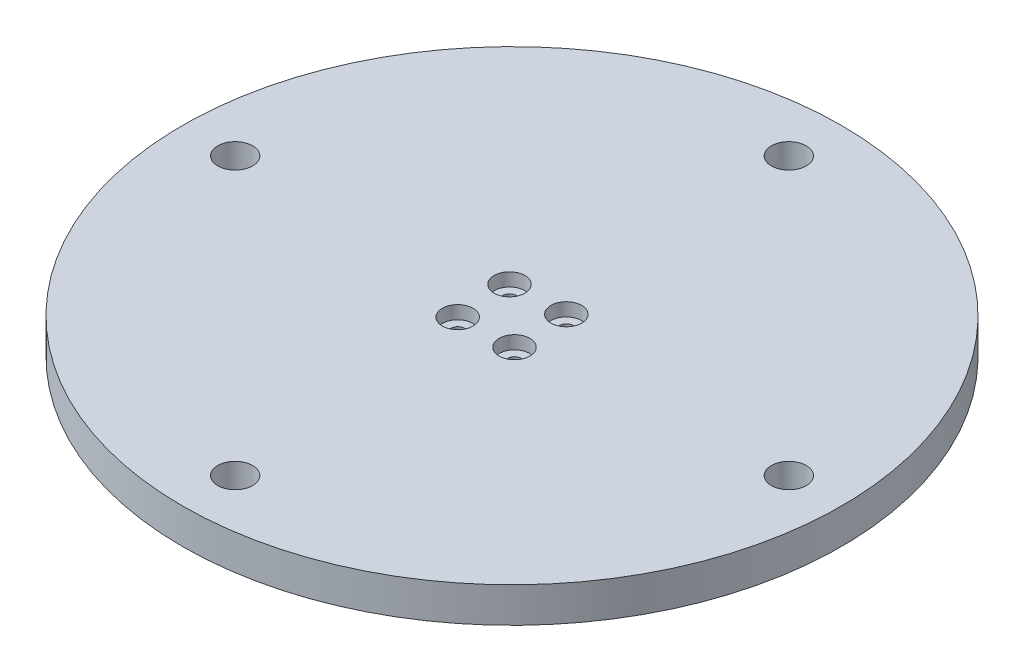
ISO-10303-21;
HEADER;
FILE_DESCRIPTION(('STEP AP214'),'2;1');
FILE_NAME('part.step','',(''),(''),'','','');
FILE_SCHEMA(('AUTOMOTIVE_DESIGN { 1 0 10303 214 1 1 1 1 }'));
ENDSEC;
DATA;
#1=APPLICATION_CONTEXT('core data for automotive mechanical design processes');
#2=APPLICATION_PROTOCOL_DEFINITION('international standard','automotive_design',2000,#1);
#3=PRODUCT_CONTEXT('',#1,'mechanical');
#4=PRODUCT('Part','Part','',(#3));
#5=PRODUCT_RELATED_PRODUCT_CATEGORY('part','',(#4));
#6=PRODUCT_DEFINITION_FORMATION('','',#4);
#7=PRODUCT_DEFINITION_CONTEXT('part definition',#1,'design');
#8=PRODUCT_DEFINITION('design','',#6,#7);
#9=PRODUCT_DEFINITION_SHAPE('','',#8);
#10=(LENGTH_UNIT() NAMED_UNIT(*) SI_UNIT(.MILLI.,.METRE.));
#11=(NAMED_UNIT(*) PLANE_ANGLE_UNIT() SI_UNIT($,.RADIAN.));
#12=(NAMED_UNIT(*) SI_UNIT($,.STERADIAN.) SOLID_ANGLE_UNIT());
#13=UNCERTAINTY_MEASURE_WITH_UNIT(LENGTH_MEASURE(1.E-05),#10,'distance_accuracy_value','');
#14=(GEOMETRIC_REPRESENTATION_CONTEXT(3) GLOBAL_UNCERTAINTY_ASSIGNED_CONTEXT((#13)) GLOBAL_UNIT_ASSIGNED_CONTEXT((#10,
#11,#12)) REPRESENTATION_CONTEXT('',''));
#15=CARTESIAN_POINT('',(0.,0.,0.));
#16=DIRECTION('',(0.,0.,1.));
#17=DIRECTION('',(1.,0.,0.));
#18=AXIS2_PLACEMENT_3D('',#15,#16,#17);
#19=CARTESIAN_POINT('',(5.89694767315849,16.,-6.46440315420037));
#20=DIRECTION('',(0.,1.,0.));
#21=DIRECTION('',(0.,0.,1.));
#22=AXIS2_PLACEMENT_3D('',#19,#20,#21);
#23=CYLINDRICAL_SURFACE('',#22,1.59);
#24=CARTESIAN_POINT('',(5.89694767315849,18.,-6.46440315420037));
#25=DIRECTION('',(0.,1.,0.));
#26=DIRECTION('',(0.,0.,1.));
#27=AXIS2_PLACEMENT_3D('',#24,#25,#26);
#28=CIRCLE('',#27,1.59);
#29=CARTESIAN_POINT('',(5.89694767315849,18.,-4.87440315420036));
#30=VERTEX_POINT('',#29);
#31=EDGE_CURVE('E102',#30,#30,#28,.T.);
#32=ORIENTED_EDGE('',*,*,#31,.F.);
#33=EDGE_LOOP('',(#32));
#34=FACE_BOUND('',#33,.T.);
#35=CARTESIAN_POINT('',(5.89694767315849,23.,-6.46440315420037));
#36=DIRECTION('',(0.,1.,0.));
#37=DIRECTION('',(0.,0.,1.));
#38=AXIS2_PLACEMENT_3D('',#35,#36,#37);
#39=CIRCLE('',#38,1.59);
#40=CARTESIAN_POINT('',(5.89694767315849,23.,-4.87440315420036));
#41=VERTEX_POINT('',#40);
#42=EDGE_CURVE('E51',#41,#41,#39,.F.);
#43=ORIENTED_EDGE('',*,*,#42,.F.);
#44=EDGE_LOOP('',(#43));
#45=FACE_BOUND('',#44,.T.);
#46=ADVANCED_FACE('F47',(#34,#45),#23,.F.);
#47=CARTESIAN_POINT('',(-5.89694767315863,16.,6.46440315419948));
#48=DIRECTION('',(0.,1.,0.));
#49=DIRECTION('',(0.,0.,1.));
#50=AXIS2_PLACEMENT_3D('',#47,#48,#49);
#51=CYLINDRICAL_SURFACE('',#50,1.59);
#52=CARTESIAN_POINT('',(-5.89694767315863,18.,6.46440315419948));
#53=DIRECTION('',(0.,1.,0.));
#54=DIRECTION('',(0.,0.,1.));
#55=AXIS2_PLACEMENT_3D('',#52,#53,#54);
#56=CIRCLE('',#55,1.59);
#57=CARTESIAN_POINT('',(-5.89694767315863,18.,8.05440315419948));
#58=VERTEX_POINT('',#57);
#59=EDGE_CURVE('E105',#58,#58,#56,.T.);
#60=ORIENTED_EDGE('',*,*,#59,.F.);
#61=EDGE_LOOP('',(#60));
#62=FACE_BOUND('',#61,.T.);
#63=CARTESIAN_POINT('',(-5.89694767315863,23.,6.46440315419948));
#64=DIRECTION('',(0.,1.,0.));
#65=DIRECTION('',(0.,0.,1.));
#66=AXIS2_PLACEMENT_3D('',#63,#64,#65);
#67=CIRCLE('',#66,1.59);
#68=CARTESIAN_POINT('',(-5.89694767315863,23.,8.05440315419948));
#69=VERTEX_POINT('',#68);
#70=EDGE_CURVE('E71',#69,#69,#67,.F.);
#71=ORIENTED_EDGE('',*,*,#70,.F.);
#72=EDGE_LOOP('',(#71));
#73=FACE_BOUND('',#72,.T.);
#74=ADVANCED_FACE('F144',(#62,#73),#51,.F.);
#75=CARTESIAN_POINT('',(6.49205336615537,16.,5.92217070599874));
#76=DIRECTION('',(0.,1.,0.));
#77=DIRECTION('',(0.,0.,1.));
#78=AXIS2_PLACEMENT_3D('',#75,#76,#77);
#79=CYLINDRICAL_SURFACE('',#78,1.59);
#80=CARTESIAN_POINT('',(6.49205336615537,18.,5.92217070599874));
#81=DIRECTION('',(0.,1.,0.));
#82=DIRECTION('',(0.,0.,1.));
#83=AXIS2_PLACEMENT_3D('',#80,#81,#82);
#84=CIRCLE('',#83,1.59);
#85=CARTESIAN_POINT('',(6.49205336615537,18.,7.51217070599874));
#86=VERTEX_POINT('',#85);
#87=EDGE_CURVE('E108',#86,#86,#84,.T.);
#88=ORIENTED_EDGE('',*,*,#87,.F.);
#89=EDGE_LOOP('',(#88));
#90=FACE_BOUND('',#89,.T.);
#91=CARTESIAN_POINT('',(6.49205336615537,23.,5.92217070599874));
#92=DIRECTION('',(0.,1.,0.));
#93=DIRECTION('',(0.,0.,1.));
#94=AXIS2_PLACEMENT_3D('',#91,#92,#93);
#95=CIRCLE('',#94,1.59);
#96=CARTESIAN_POINT('',(6.49205336615537,23.,7.51217070599874));
#97=VERTEX_POINT('',#96);
#98=EDGE_CURVE('E68',#97,#97,#95,.F.);
#99=ORIENTED_EDGE('',*,*,#98,.F.);
#100=EDGE_LOOP('',(#99));
#101=FACE_BOUND('',#100,.T.);
#102=ADVANCED_FACE('F151',(#90,#101),#79,.F.);
#103=CARTESIAN_POINT('',(-6.46440315419999,16.,-5.896947673159));
#104=DIRECTION('',(0.,1.,0.));
#105=DIRECTION('',(0.,0.,1.));
#106=AXIS2_PLACEMENT_3D('',#103,#104,#105);
#107=CYLINDRICAL_SURFACE('',#106,1.58750000000001);
#108=CARTESIAN_POINT('',(-6.46440315419999,18.,-5.896947673159));
#109=DIRECTION('',(0.,1.,0.));
#110=DIRECTION('',(0.,0.,1.));
#111=AXIS2_PLACEMENT_3D('',#108,#109,#110);
#112=CIRCLE('',#111,1.58750000000001);
#113=CARTESIAN_POINT('',(-6.46440315419999,18.,-4.309447673159));
#114=VERTEX_POINT('',#113);
#115=EDGE_CURVE('E111',#114,#114,#112,.T.);
#116=ORIENTED_EDGE('',*,*,#115,.F.);
#117=EDGE_LOOP('',(#116));
#118=FACE_BOUND('',#117,.T.);
#119=CARTESIAN_POINT('',(-6.46440315419999,23.,-5.896947673159));
#120=DIRECTION('',(0.,1.,0.));
#121=DIRECTION('',(0.,0.,1.));
#122=AXIS2_PLACEMENT_3D('',#119,#120,#121);
#123=CIRCLE('',#122,1.58750000000001);
#124=CARTESIAN_POINT('',(-6.46440315419999,23.,-4.309447673159));
#125=VERTEX_POINT('',#124);
#126=EDGE_CURVE('E65',#125,#125,#123,.F.);
#127=ORIENTED_EDGE('',*,*,#126,.F.);
#128=EDGE_LOOP('',(#127));
#129=FACE_BOUND('',#128,.T.);
#130=ADVANCED_FACE('F158',(#118,#129),#107,.F.);
#131=CARTESIAN_POINT('',(0.,0.,0.));
#132=DIRECTION('',(0.,1.,0.));
#133=DIRECTION('',(0.,0.,1.));
#134=AXIS2_PLACEMENT_3D('',#131,#132,#133);
#135=PLANE('',#134);
#136=CARTESIAN_POINT('',(0.,0.,0.));
#137=DIRECTION('',(0.,1.,0.));
#138=DIRECTION('',(0.,0.,1.));
#139=AXIS2_PLACEMENT_3D('',#136,#137,#138);
#140=CIRCLE('',#139,15.);
#141=CARTESIAN_POINT('',(0.,0.,15.));
#142=VERTEX_POINT('',#141);
#143=EDGE_CURVE('E55',#142,#142,#140,.T.);
#144=ORIENTED_EDGE('',*,*,#143,.F.);
#145=EDGE_LOOP('',(#144));
#146=FACE_BOUND('',#145,.T.);
#147=CARTESIAN_POINT('',(0.,0.,0.));
#148=DIRECTION('',(0.,1.,0.));
#149=DIRECTION('',(1.,0.,0.));
#150=AXIS2_PLACEMENT_3D('',#147,#148,#149);
#151=CIRCLE('',#150,13.);
#152=CARTESIAN_POINT('',(13.,0.,0.));
#153=VERTEX_POINT('',#152);
#154=EDGE_CURVE('E60',#153,#153,#151,.T.);
#155=ORIENTED_EDGE('',*,*,#154,.T.);
#156=EDGE_LOOP('',(#155));
#157=FACE_BOUND('',#156,.T.);
#158=ADVANCED_FACE('F126',(#146,#157),#135,.F.);
#159=CARTESIAN_POINT('',(0.,18.,0.));
#160=DIRECTION('',(0.,-1.,0.));
#161=DIRECTION('',(0.,0.,-1.));
#162=AXIS2_PLACEMENT_3D('',#159,#160,#161);
#163=CYLINDRICAL_SURFACE('',#162,15.);
#164=CARTESIAN_POINT('',(0.,18.,0.));
#165=DIRECTION('',(0.,1.,0.));
#166=DIRECTION('',(0.,0.,1.));
#167=AXIS2_PLACEMENT_3D('',#164,#165,#166);
#168=CIRCLE('',#167,15.);
#169=CARTESIAN_POINT('',(0.,18.,15.));
#170=VERTEX_POINT('',#169);
#171=EDGE_CURVE('E11',#170,#170,#168,.T.);
#172=ORIENTED_EDGE('',*,*,#171,.F.);
#173=EDGE_LOOP('',(#172));
#174=FACE_BOUND('',#173,.T.);
#175=ORIENTED_EDGE('',*,*,#143,.T.);
#176=EDGE_LOOP('',(#175));
#177=FACE_BOUND('',#176,.T.);
#178=ADVANCED_FACE('F49',(#174,#177),#163,.T.);
#179=CARTESIAN_POINT('',(0.,18.,0.));
#180=DIRECTION('',(0.,-1.,0.));
#181=DIRECTION('',(0.,0.,-1.));
#182=AXIS2_PLACEMENT_3D('',#179,#180,#181);
#183=CYLINDRICAL_SURFACE('',#182,13.);
#184=CARTESIAN_POINT('',(0.,18.,0.));
#185=DIRECTION('',(0.,1.,0.));
#186=DIRECTION('',(1.,0.,0.));
#187=AXIS2_PLACEMENT_3D('',#184,#185,#186);
#188=CIRCLE('',#187,13.);
#189=CARTESIAN_POINT('',(13.,18.,0.));
#190=VERTEX_POINT('',#189);
#191=EDGE_CURVE('E118',#190,#190,#188,.T.);
#192=ORIENTED_EDGE('',*,*,#191,.T.);
#193=EDGE_LOOP('',(#192));
#194=FACE_BOUND('',#193,.T.);
#195=ORIENTED_EDGE('',*,*,#154,.F.);
#196=EDGE_LOOP('',(#195));
#197=FACE_BOUND('',#196,.T.);
#198=ADVANCED_FACE('F128',(#194,#197),#183,.F.);
#199=CARTESIAN_POINT('',(0.,18.,0.));
#200=DIRECTION('',(0.,1.,0.));
#201=DIRECTION('',(0.,0.,1.));
#202=AXIS2_PLACEMENT_3D('',#199,#200,#201);
#203=PLANE('',#202);
#204=ORIENTED_EDGE('',*,*,#115,.T.);
#205=EDGE_LOOP('',(#204));
#206=FACE_BOUND('',#205,.T.);
#207=ORIENTED_EDGE('',*,*,#87,.T.);
#208=EDGE_LOOP('',(#207));
#209=FACE_BOUND('',#208,.T.);
#210=ORIENTED_EDGE('',*,*,#59,.T.);
#211=EDGE_LOOP('',(#210));
#212=FACE_BOUND('',#211,.T.);
#213=ORIENTED_EDGE('',*,*,#31,.T.);
#214=EDGE_LOOP('',(#213));
#215=FACE_BOUND('',#214,.T.);
#216=ORIENTED_EDGE('',*,*,#191,.F.);
#217=EDGE_LOOP('',(#216));
#218=FACE_BOUND('',#217,.T.);
#219=ADVANCED_FACE('F130',(#206,#209,#212,#215,#218),#203,.F.);
#220=CARTESIAN_POINT('',(0.,26.,0.));
#221=DIRECTION('',(0.,-1.,0.));
#222=DIRECTION('',(0.,0.,-1.));
#223=AXIS2_PLACEMENT_3D('',#220,#221,#222);
#224=CYLINDRICAL_SURFACE('',#223,75.);
#225=CARTESIAN_POINT('',(0.,26.,0.));
#226=DIRECTION('',(0.,1.,0.));
#227=DIRECTION('',(0.,0.,1.));
#228=AXIS2_PLACEMENT_3D('',#225,#226,#227);
#229=CIRCLE('',#228,75.);
#230=CARTESIAN_POINT('',(0.,26.,75.));
#231=VERTEX_POINT('',#230);
#232=EDGE_CURVE('E115',#231,#231,#229,.T.);
#233=ORIENTED_EDGE('',*,*,#232,.F.);
#234=EDGE_LOOP('',(#233));
#235=FACE_BOUND('',#234,.T.);
#236=CARTESIAN_POINT('',(0.,18.,0.));
#237=DIRECTION('',(0.,1.,0.));
#238=DIRECTION('',(0.,0.,1.));
#239=AXIS2_PLACEMENT_3D('',#236,#237,#238);
#240=CIRCLE('',#239,75.);
#241=CARTESIAN_POINT('',(0.,18.,75.));
#242=VERTEX_POINT('',#241);
#243=EDGE_CURVE('E114',#242,#242,#240,.T.);
#244=ORIENTED_EDGE('',*,*,#243,.T.);
#245=EDGE_LOOP('',(#244));
#246=FACE_BOUND('',#245,.T.);
#247=ADVANCED_FACE('F137',(#235,#246),#224,.T.);
#248=CARTESIAN_POINT('',(0.,26.,0.));
#249=DIRECTION('',(0.,1.,0.));
#250=DIRECTION('',(0.,0.,1.));
#251=AXIS2_PLACEMENT_3D('',#248,#249,#250);
#252=PLANE('',#251);
#253=CARTESIAN_POINT('',(6.49205336615537,26.,5.92217070599874));
#254=DIRECTION('',(0.,1.,0.));
#255=DIRECTION('',(0.,0.,1.));
#256=AXIS2_PLACEMENT_3D('',#253,#254,#255);
#257=CIRCLE('',#256,3.5);
#258=CARTESIAN_POINT('',(6.49205336615537,26.,9.42217070599874));
#259=VERTEX_POINT('',#258);
#260=EDGE_CURVE('E355',#259,#259,#257,.T.);
#261=ORIENTED_EDGE('',*,*,#260,.F.);
#262=EDGE_LOOP('',(#261));
#263=FACE_BOUND('',#262,.T.);
#264=CARTESIAN_POINT('',(-5.89694767315863,26.,6.46440315419948));
#265=DIRECTION('',(0.,1.,0.));
#266=DIRECTION('',(0.,0.,1.));
#267=AXIS2_PLACEMENT_3D('',#264,#265,#266);
#268=CIRCLE('',#267,3.5);
#269=CARTESIAN_POINT('',(-5.89694767315863,26.,9.96440315419948));
#270=VERTEX_POINT('',#269);
#271=EDGE_CURVE('E361',#270,#270,#268,.T.);
#272=ORIENTED_EDGE('',*,*,#271,.F.);
#273=EDGE_LOOP('',(#272));
#274=FACE_BOUND('',#273,.T.);
#275=CARTESIAN_POINT('',(-6.46440315419999,26.,-5.896947673159));
#276=DIRECTION('',(0.,1.,0.));
#277=DIRECTION('',(0.,0.,1.));
#278=AXIS2_PLACEMENT_3D('',#275,#276,#277);
#279=CIRCLE('',#278,3.5);
#280=CARTESIAN_POINT('',(-6.46440315419999,26.,-2.396947673159));
#281=VERTEX_POINT('',#280);
#282=EDGE_CURVE('E333',#281,#281,#279,.T.);
#283=ORIENTED_EDGE('',*,*,#282,.F.);
#284=EDGE_LOOP('',(#283));
#285=FACE_BOUND('',#284,.T.);
#286=CARTESIAN_POINT('',(5.89694767315849,26.,-6.46440315420037));
#287=DIRECTION('',(0.,1.,0.));
#288=DIRECTION('',(0.,0.,1.));
#289=AXIS2_PLACEMENT_3D('',#286,#287,#288);
#290=CIRCLE('',#289,3.5);
#291=CARTESIAN_POINT('',(5.89694767315849,26.,-2.96440315420037));
#292=VERTEX_POINT('',#291);
#293=EDGE_CURVE('E331',#292,#292,#290,.T.);
#294=ORIENTED_EDGE('',*,*,#293,.F.);
#295=EDGE_LOOP('',(#294));
#296=FACE_BOUND('',#295,.T.);
#297=CARTESIAN_POINT('',(0.,26.,-63.));
#298=DIRECTION('',(0.,1.,0.));
#299=DIRECTION('',(0.,0.,1.));
#300=AXIS2_PLACEMENT_3D('',#297,#298,#299);
#301=CIRCLE('',#300,3.969);
#302=CARTESIAN_POINT('',(0.,26.,-59.031));
#303=VERTEX_POINT('',#302);
#304=EDGE_CURVE('E99',#303,#303,#301,.T.);
#305=ORIENTED_EDGE('',*,*,#304,.F.);
#306=EDGE_LOOP('',(#305));
#307=FACE_BOUND('',#306,.T.);
#308=CARTESIAN_POINT('',(-63.,26.,0.));
#309=DIRECTION('',(0.,1.,0.));
#310=DIRECTION('',(0.,0.,1.));
#311=AXIS2_PLACEMENT_3D('',#308,#309,#310);
#312=CIRCLE('',#311,3.969);
#313=CARTESIAN_POINT('',(-63.,26.,3.969));
#314=VERTEX_POINT('',#313);
#315=EDGE_CURVE('E96',#314,#314,#312,.T.);
#316=ORIENTED_EDGE('',*,*,#315,.F.);
#317=EDGE_LOOP('',(#316));
#318=FACE_BOUND('',#317,.T.);
#319=CARTESIAN_POINT('',(0.,26.,63.));
#320=DIRECTION('',(0.,1.,0.));
#321=DIRECTION('',(0.,0.,1.));
#322=AXIS2_PLACEMENT_3D('',#319,#320,#321);
#323=CIRCLE('',#322,3.969);
#324=CARTESIAN_POINT('',(0.,26.,66.969));
#325=VERTEX_POINT('',#324);
#326=EDGE_CURVE('E92',#325,#325,#323,.T.);
#327=ORIENTED_EDGE('',*,*,#326,.F.);
#328=EDGE_LOOP('',(#327));
#329=FACE_BOUND('',#328,.T.);
#330=CARTESIAN_POINT('',(63.,26.,0.));
#331=DIRECTION('',(0.,1.,0.));
#332=DIRECTION('',(0.,0.,1.));
#333=AXIS2_PLACEMENT_3D('',#330,#331,#332);
#334=CIRCLE('',#333,3.96899999999998);
#335=CARTESIAN_POINT('',(63.,26.,3.96899999999997));
#336=VERTEX_POINT('',#335);
#337=EDGE_CURVE('E89',#336,#336,#334,.T.);
#338=ORIENTED_EDGE('',*,*,#337,.F.);
#339=EDGE_LOOP('',(#338));
#340=FACE_BOUND('',#339,.T.);
#341=ORIENTED_EDGE('',*,*,#232,.T.);
#342=EDGE_LOOP('',(#341));
#343=FACE_BOUND('',#342,.T.);
#344=ADVANCED_FACE('F160',(#263,#274,#285,#296,#307,#318,#329,#340,#343),#252,.T.);
#345=CARTESIAN_POINT('',(0.,18.,-63.));
#346=DIRECTION('',(0.,-1.,0.));
#347=DIRECTION('',(0.,0.,-1.));
#348=AXIS2_PLACEMENT_3D('',#345,#346,#347);
#349=CIRCLE('',#348,3.969);
#350=CARTESIAN_POINT('',(0.,18.,-66.969));
#351=VERTEX_POINT('',#350);
#352=EDGE_CURVE('E93',#351,#351,#349,.T.);
#353=ORIENTED_EDGE('',*,*,#352,.F.);
#354=EDGE_LOOP('',(#353));
#355=FACE_BOUND('',#354,.T.);
#356=CARTESIAN_POINT('',(-63.,18.,0.));
#357=DIRECTION('',(0.,-1.,0.));
#358=DIRECTION('',(0.,0.,-1.));
#359=AXIS2_PLACEMENT_3D('',#356,#357,#358);
#360=CIRCLE('',#359,3.969);
#361=CARTESIAN_POINT('',(-63.,18.,-3.969));
#362=VERTEX_POINT('',#361);
#363=EDGE_CURVE('E85',#362,#362,#360,.T.);
#364=ORIENTED_EDGE('',*,*,#363,.F.);
#365=EDGE_LOOP('',(#364));
#366=FACE_BOUND('',#365,.T.);
#367=CARTESIAN_POINT('',(0.,18.,63.));
#368=DIRECTION('',(0.,-1.,0.));
#369=DIRECTION('',(0.,0.,-1.));
#370=AXIS2_PLACEMENT_3D('',#367,#368,#369);
#371=CIRCLE('',#370,3.969);
#372=CARTESIAN_POINT('',(0.,18.,59.031));
#373=VERTEX_POINT('',#372);
#374=EDGE_CURVE('E80',#373,#373,#371,.T.);
#375=ORIENTED_EDGE('',*,*,#374,.F.);
#376=EDGE_LOOP('',(#375));
#377=FACE_BOUND('',#376,.T.);
#378=CARTESIAN_POINT('',(63.,18.,0.));
#379=DIRECTION('',(0.,-1.,0.));
#380=DIRECTION('',(0.,0.,-1.));
#381=AXIS2_PLACEMENT_3D('',#378,#379,#380);
#382=CIRCLE('',#381,3.96899999999998);
#383=CARTESIAN_POINT('',(63.,18.,-3.96899999999999));
#384=VERTEX_POINT('',#383);
#385=EDGE_CURVE('E76',#384,#384,#382,.T.);
#386=ORIENTED_EDGE('',*,*,#385,.F.);
#387=EDGE_LOOP('',(#386));
#388=FACE_BOUND('',#387,.T.);
#389=ORIENTED_EDGE('',*,*,#171,.T.);
#390=EDGE_LOOP('',(#389));
#391=FACE_BOUND('',#390,.T.);
#392=ORIENTED_EDGE('',*,*,#243,.F.);
#393=EDGE_LOOP('',(#392));
#394=FACE_BOUND('',#393,.T.);
#395=ADVANCED_FACE('F140',(#355,#366,#377,#388,#391,#394),#203,.F.);
#396=CARTESIAN_POINT('',(63.,28.,0.));
#397=DIRECTION('',(0.,-1.,0.));
#398=DIRECTION('',(0.,0.,-1.));
#399=AXIS2_PLACEMENT_3D('',#396,#397,#398);
#400=CYLINDRICAL_SURFACE('',#399,3.96899999999998);
#401=ORIENTED_EDGE('',*,*,#337,.T.);
#402=EDGE_LOOP('',(#401));
#403=FACE_BOUND('',#402,.T.);
#404=ORIENTED_EDGE('',*,*,#385,.T.);
#405=EDGE_LOOP('',(#404));
#406=FACE_BOUND('',#405,.T.);
#407=ADVANCED_FACE('F164',(#403,#406),#400,.F.);
#408=CARTESIAN_POINT('',(0.,28.,63.));
#409=DIRECTION('',(0.,-1.,0.));
#410=DIRECTION('',(0.,0.,-1.));
#411=AXIS2_PLACEMENT_3D('',#408,#409,#410);
#412=CYLINDRICAL_SURFACE('',#411,3.969);
#413=ORIENTED_EDGE('',*,*,#326,.T.);
#414=EDGE_LOOP('',(#413));
#415=FACE_BOUND('',#414,.T.);
#416=ORIENTED_EDGE('',*,*,#374,.T.);
#417=EDGE_LOOP('',(#416));
#418=FACE_BOUND('',#417,.T.);
#419=ADVANCED_FACE('F192',(#415,#418),#412,.F.);
#420=CARTESIAN_POINT('',(-63.,28.,0.));
#421=DIRECTION('',(0.,-1.,0.));
#422=DIRECTION('',(0.,0.,-1.));
#423=AXIS2_PLACEMENT_3D('',#420,#421,#422);
#424=CYLINDRICAL_SURFACE('',#423,3.969);
#425=ORIENTED_EDGE('',*,*,#315,.T.);
#426=EDGE_LOOP('',(#425));
#427=FACE_BOUND('',#426,.T.);
#428=ORIENTED_EDGE('',*,*,#363,.T.);
#429=EDGE_LOOP('',(#428));
#430=FACE_BOUND('',#429,.T.);
#431=ADVANCED_FACE('F201',(#427,#430),#424,.F.);
#432=CARTESIAN_POINT('',(0.,28.,-63.));
#433=DIRECTION('',(0.,-1.,0.));
#434=DIRECTION('',(0.,0.,-1.));
#435=AXIS2_PLACEMENT_3D('',#432,#433,#434);
#436=CYLINDRICAL_SURFACE('',#435,3.969);
#437=ORIENTED_EDGE('',*,*,#304,.T.);
#438=EDGE_LOOP('',(#437));
#439=FACE_BOUND('',#438,.T.);
#440=ORIENTED_EDGE('',*,*,#352,.T.);
#441=EDGE_LOOP('',(#440));
#442=FACE_BOUND('',#441,.T.);
#443=ADVANCED_FACE('F209',(#439,#442),#436,.F.);
#444=CARTESIAN_POINT('',(-6.46440315419999,23.,-5.896947673159));
#445=DIRECTION('',(0.,1.,0.));
#446=DIRECTION('',(0.,0.,1.));
#447=AXIS2_PLACEMENT_3D('',#444,#445,#446);
#448=PLANE('',#447);
#449=CARTESIAN_POINT('',(-6.46440315419999,23.,-5.896947673159));
#450=DIRECTION('',(0.,1.,0.));
#451=DIRECTION('',(0.,0.,1.));
#452=AXIS2_PLACEMENT_3D('',#449,#450,#451);
#453=CIRCLE('',#452,3.5);
#454=CARTESIAN_POINT('',(-6.46440315419999,23.,-2.396947673159));
#455=VERTEX_POINT('',#454);
#456=EDGE_CURVE('E337',#455,#455,#453,.T.);
#457=ORIENTED_EDGE('',*,*,#456,.T.);
#458=EDGE_LOOP('',(#457));
#459=FACE_BOUND('',#458,.T.);
#460=ORIENTED_EDGE('',*,*,#126,.T.);
#461=EDGE_LOOP('',(#460));
#462=FACE_BOUND('',#461,.T.);
#463=ADVANCED_FACE('F217',(#459,#462),#448,.T.);
#464=CARTESIAN_POINT('',(-6.46440315419999,23.,-5.896947673159));
#465=DIRECTION('',(0.,1.,0.));
#466=DIRECTION('',(0.,0.,1.));
#467=AXIS2_PLACEMENT_3D('',#464,#465,#466);
#468=CYLINDRICAL_SURFACE('',#467,3.5);
#469=ORIENTED_EDGE('',*,*,#456,.F.);
#470=EDGE_LOOP('',(#469));
#471=FACE_BOUND('',#470,.T.);
#472=ORIENTED_EDGE('',*,*,#282,.T.);
#473=EDGE_LOOP('',(#472));
#474=FACE_BOUND('',#473,.T.);
#475=ADVANCED_FACE('F253',(#471,#474),#468,.F.);
#476=CARTESIAN_POINT('',(6.49205336615537,23.,5.92217070599874));
#477=DIRECTION('',(0.,1.,0.));
#478=DIRECTION('',(0.,0.,1.));
#479=AXIS2_PLACEMENT_3D('',#476,#477,#478);
#480=PLANE('',#479);
#481=CARTESIAN_POINT('',(6.49205336615537,23.,5.92217070599874));
#482=DIRECTION('',(0.,1.,0.));
#483=DIRECTION('',(0.,0.,1.));
#484=AXIS2_PLACEMENT_3D('',#481,#482,#483);
#485=CIRCLE('',#484,3.5);
#486=CARTESIAN_POINT('',(6.49205336615537,23.,9.42217070599874));
#487=VERTEX_POINT('',#486);
#488=EDGE_CURVE('E352',#487,#487,#485,.T.);
#489=ORIENTED_EDGE('',*,*,#488,.T.);
#490=EDGE_LOOP('',(#489));
#491=FACE_BOUND('',#490,.T.);
#492=ORIENTED_EDGE('',*,*,#98,.T.);
#493=EDGE_LOOP('',(#492));
#494=FACE_BOUND('',#493,.T.);
#495=ADVANCED_FACE('F263',(#491,#494),#480,.T.);
#496=CARTESIAN_POINT('',(6.49205336615537,23.,5.92217070599874));
#497=DIRECTION('',(0.,1.,0.));
#498=DIRECTION('',(0.,0.,1.));
#499=AXIS2_PLACEMENT_3D('',#496,#497,#498);
#500=CYLINDRICAL_SURFACE('',#499,3.5);
#501=ORIENTED_EDGE('',*,*,#488,.F.);
#502=EDGE_LOOP('',(#501));
#503=FACE_BOUND('',#502,.T.);
#504=ORIENTED_EDGE('',*,*,#260,.T.);
#505=EDGE_LOOP('',(#504));
#506=FACE_BOUND('',#505,.T.);
#507=ADVANCED_FACE('F273',(#503,#506),#500,.F.);
#508=CARTESIAN_POINT('',(-5.89694767315863,23.,6.46440315419948));
#509=DIRECTION('',(0.,1.,0.));
#510=DIRECTION('',(0.,0.,1.));
#511=AXIS2_PLACEMENT_3D('',#508,#509,#510);
#512=PLANE('',#511);
#513=CARTESIAN_POINT('',(-5.89694767315863,23.,6.46440315419948));
#514=DIRECTION('',(0.,1.,0.));
#515=DIRECTION('',(0.,0.,1.));
#516=AXIS2_PLACEMENT_3D('',#513,#514,#515);
#517=CIRCLE('',#516,3.5);
#518=CARTESIAN_POINT('',(-5.89694767315863,23.,9.96440315419948));
#519=VERTEX_POINT('',#518);
#520=EDGE_CURVE('E358',#519,#519,#517,.T.);
#521=ORIENTED_EDGE('',*,*,#520,.T.);
#522=EDGE_LOOP('',(#521));
#523=FACE_BOUND('',#522,.T.);
#524=ORIENTED_EDGE('',*,*,#70,.T.);
#525=EDGE_LOOP('',(#524));
#526=FACE_BOUND('',#525,.T.);
#527=ADVANCED_FACE('F283',(#523,#526),#512,.T.);
#528=CARTESIAN_POINT('',(-5.89694767315863,23.,6.46440315419948));
#529=DIRECTION('',(0.,1.,0.));
#530=DIRECTION('',(0.,0.,1.));
#531=AXIS2_PLACEMENT_3D('',#528,#529,#530);
#532=CYLINDRICAL_SURFACE('',#531,3.5);
#533=ORIENTED_EDGE('',*,*,#520,.F.);
#534=EDGE_LOOP('',(#533));
#535=FACE_BOUND('',#534,.T.);
#536=ORIENTED_EDGE('',*,*,#271,.T.);
#537=EDGE_LOOP('',(#536));
#538=FACE_BOUND('',#537,.T.);
#539=ADVANCED_FACE('F293',(#535,#538),#532,.F.);
#540=CARTESIAN_POINT('',(5.89694767315849,23.,-6.46440315420037));
#541=DIRECTION('',(0.,1.,0.));
#542=DIRECTION('',(0.,0.,1.));
#543=AXIS2_PLACEMENT_3D('',#540,#541,#542);
#544=PLANE('',#543);
#545=CARTESIAN_POINT('',(5.89694767315849,23.,-6.46440315420037));
#546=DIRECTION('',(0.,1.,0.));
#547=DIRECTION('',(0.,0.,1.));
#548=AXIS2_PLACEMENT_3D('',#545,#546,#547);
#549=CIRCLE('',#548,3.5);
#550=CARTESIAN_POINT('',(5.89694767315849,23.,-2.96440315420037));
#551=VERTEX_POINT('',#550);
#552=EDGE_CURVE('E69',#551,#551,#549,.T.);
#553=ORIENTED_EDGE('',*,*,#552,.T.);
#554=EDGE_LOOP('',(#553));
#555=FACE_BOUND('',#554,.T.);
#556=ORIENTED_EDGE('',*,*,#42,.T.);
#557=EDGE_LOOP('',(#556));
#558=FACE_BOUND('',#557,.T.);
#559=ADVANCED_FACE('F303',(#555,#558),#544,.T.);
#560=CARTESIAN_POINT('',(5.89694767315849,23.,-6.46440315420037));
#561=DIRECTION('',(0.,1.,0.));
#562=DIRECTION('',(0.,0.,1.));
#563=AXIS2_PLACEMENT_3D('',#560,#561,#562);
#564=CYLINDRICAL_SURFACE('',#563,3.5);
#565=ORIENTED_EDGE('',*,*,#552,.F.);
#566=EDGE_LOOP('',(#565));
#567=FACE_BOUND('',#566,.T.);
#568=ORIENTED_EDGE('',*,*,#293,.T.);
#569=EDGE_LOOP('',(#568));
#570=FACE_BOUND('',#569,.T.);
#571=ADVANCED_FACE('F313',(#567,#570),#564,.F.);
#572=CLOSED_SHELL('',(#46,#74,#102,#130,#158,#178,#198,#219,#247,#344,#395,#407,#419,#431,#443,
#463,#475,#495,#507,#527,#539,#559,#571));
#573=MANIFOLD_SOLID_BREP('B2',#572);
#574=ADVANCED_BREP_SHAPE_REPRESENTATION('',(#18,#573),#14);
#575=SHAPE_DEFINITION_REPRESENTATION(#9,#574);
ENDSEC;
END-ISO-10303-21;
